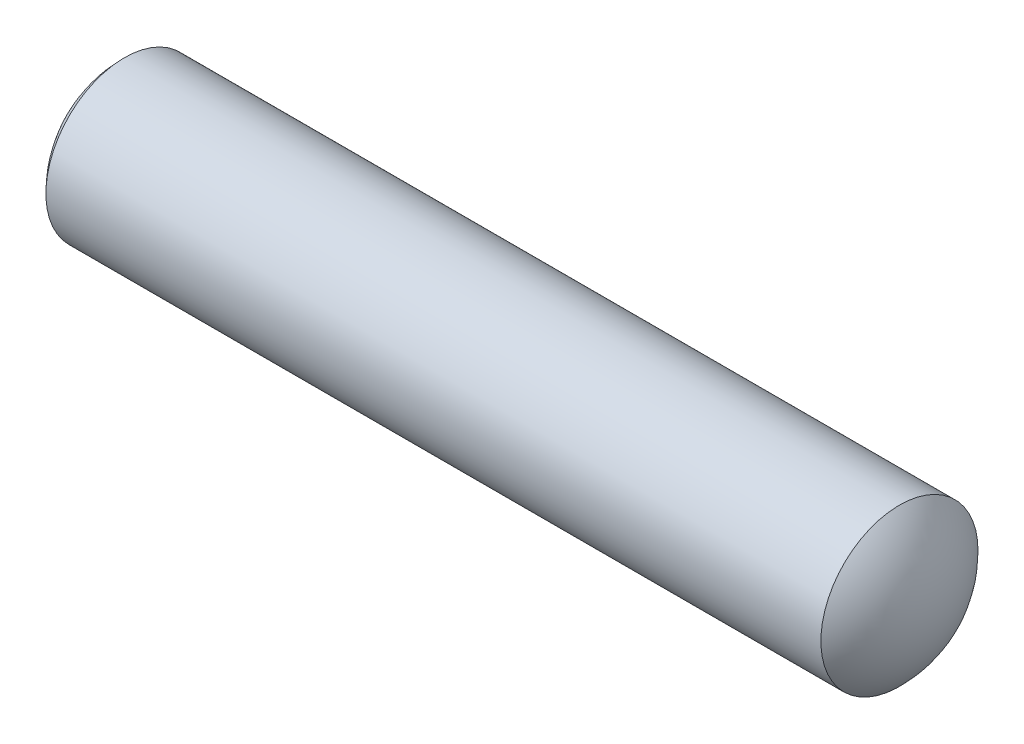
ISO-10303-21;
HEADER;
FILE_DESCRIPTION(('STEP AP214'),'2;1');
FILE_NAME('part.step','',(''),(''),'','','');
FILE_SCHEMA(('AUTOMOTIVE_DESIGN { 1 0 10303 214 1 1 1 1 }'));
ENDSEC;
DATA;
#1=APPLICATION_CONTEXT('core data for automotive mechanical design processes');
#2=APPLICATION_PROTOCOL_DEFINITION('international standard','automotive_design',2000,#1);
#3=PRODUCT_CONTEXT('',#1,'mechanical');
#4=PRODUCT('Part','Part','',(#3));
#5=PRODUCT_RELATED_PRODUCT_CATEGORY('part','',(#4));
#6=PRODUCT_DEFINITION_FORMATION('','',#4);
#7=PRODUCT_DEFINITION_CONTEXT('part definition',#1,'design');
#8=PRODUCT_DEFINITION('design','',#6,#7);
#9=PRODUCT_DEFINITION_SHAPE('','',#8);
#10=(LENGTH_UNIT() NAMED_UNIT(*) SI_UNIT(.MILLI.,.METRE.));
#11=(NAMED_UNIT(*) PLANE_ANGLE_UNIT() SI_UNIT($,.RADIAN.));
#12=(NAMED_UNIT(*) SI_UNIT($,.STERADIAN.) SOLID_ANGLE_UNIT());
#13=UNCERTAINTY_MEASURE_WITH_UNIT(LENGTH_MEASURE(1.E-05),#10,'distance_accuracy_value','');
#14=(GEOMETRIC_REPRESENTATION_CONTEXT(3) GLOBAL_UNCERTAINTY_ASSIGNED_CONTEXT((#13)) GLOBAL_UNIT_ASSIGNED_CONTEXT((#10,
#11,#12)) REPRESENTATION_CONTEXT('',''));
#15=CARTESIAN_POINT('',(0.,0.,0.));
#16=DIRECTION('',(0.,0.,1.));
#17=DIRECTION('',(1.,0.,0.));
#18=AXIS2_PLACEMENT_3D('',#15,#16,#17);
#19=CARTESIAN_POINT('',(15.1875,20.449194000159,-6.00442511768297));
#20=DIRECTION('',(0.,0.281732556841429,0.959492973614498));
#21=DIRECTION('',(1.,0.,0.));
#22=AXIS2_PLACEMENT_3D('',#19,#20,#21);
#23=SPHERICAL_SURFACE('',#22,1.8375);
#24=CARTESIAN_POINT('',(15.1875,20.449194000159,-6.00442511768297));
#25=DIRECTION('',(-1.,0.,0.));
#26=DIRECTION('',(0.,-0.959492973614497,0.28173255684143));
#27=AXIS2_PLACEMENT_3D('',#24,#25,#26);
#28=SPHERICAL_SURFACE('',#27,1.8375);
#29=CARTESIAN_POINT('',(16.4734821149612,20.449194000159,-6.00442511768297));
#30=DIRECTION('',(-1.,0.,0.));
#31=DIRECTION('',(0.,-0.959492973614497,0.28173255684143));
#32=AXIS2_PLACEMENT_3D('',#29,#30,#31);
#33=CIRCLE('',#32,1.3125);
#34=CARTESIAN_POINT('',(16.4734821149612,19.18985947229,-5.63465113682859));
#35=VERTEX_POINT('',#34);
#36=EDGE_CURVE('E11',#35,#35,#33,.T.);
#37=ORIENTED_EDGE('',*,*,#36,.F.);
#38=EDGE_LOOP('',(#37));
#39=FACE_BOUND('',#38,.T.);
#40=ADVANCED_FACE('F17',(#39),#28,.T.);
#41=CARTESIAN_POINT('',(10.,20.449194000159,-6.00442511768297));
#42=DIRECTION('',(-1.,0.,0.));
#43=DIRECTION('',(0.,-0.959492973614497,0.28173255684143));
#44=AXIS2_PLACEMENT_3D('',#41,#42,#43);
#45=CYLINDRICAL_SURFACE('',#44,1.3125);
#46=CARTESIAN_POINT('',(3.52651788503884,20.449194000159,-6.00442511768297));
#47=DIRECTION('',(-1.,0.,0.));
#48=DIRECTION('',(0.,-0.959492973614497,0.28173255684143));
#49=AXIS2_PLACEMENT_3D('',#46,#47,#48);
#50=CIRCLE('',#49,1.3125);
#51=CARTESIAN_POINT('',(3.52651788503884,19.18985947229,-5.63465113682859));
#52=VERTEX_POINT('',#51);
#53=EDGE_CURVE('E27',#52,#52,#50,.T.);
#54=ORIENTED_EDGE('',*,*,#53,.F.);
#55=EDGE_LOOP('',(#54));
#56=FACE_BOUND('',#55,.T.);
#57=ORIENTED_EDGE('',*,*,#36,.T.);
#58=EDGE_LOOP('',(#57));
#59=FACE_BOUND('',#58,.T.);
#60=ADVANCED_FACE('F47',(#56,#59),#45,.T.);
#61=CARTESIAN_POINT('',(4.8125,20.449194000159,-6.00442511768297));
#62=DIRECTION('',(0.,0.28173255684143,0.959492973614497));
#63=DIRECTION('',(-1.,0.,0.));
#64=AXIS2_PLACEMENT_3D('',#61,#62,#63);
#65=SPHERICAL_SURFACE('',#64,1.8375);
#66=CARTESIAN_POINT('',(4.8125,20.449194000159,-6.00442511768297));
#67=DIRECTION('',(-1.,0.,0.));
#68=DIRECTION('',(0.,-0.959492973614497,0.28173255684143));
#69=AXIS2_PLACEMENT_3D('',#66,#67,#68);
#70=SPHERICAL_SURFACE('',#69,1.8375);
#71=ORIENTED_EDGE('',*,*,#53,.T.);
#72=EDGE_LOOP('',(#71));
#73=FACE_BOUND('',#72,.T.);
#74=ADVANCED_FACE('F19',(#73),#70,.T.);
#75=CLOSED_SHELL('',(#40,#60,#74));
#76=MANIFOLD_SOLID_BREP('B1',#75);
#77=ADVANCED_BREP_SHAPE_REPRESENTATION('',(#18,#76),#14);
#78=SHAPE_DEFINITION_REPRESENTATION(#9,#77);
ENDSEC;
END-ISO-10303-21;
